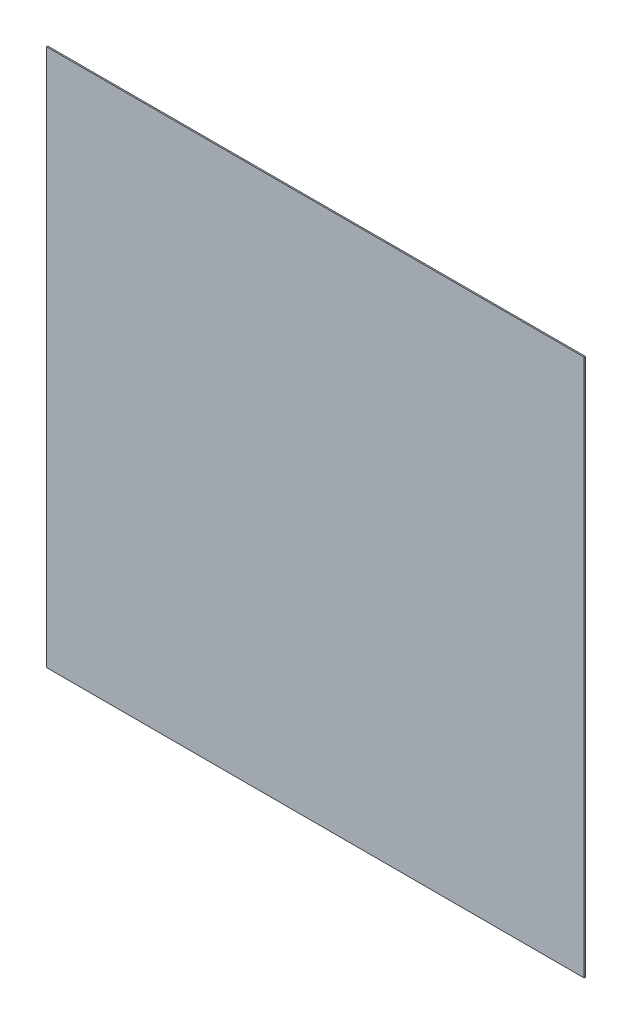
ISO-10303-21;
HEADER;
FILE_DESCRIPTION(('STEP AP214'),'2;1');
FILE_NAME('part.step','',(''),(''),'','','');
FILE_SCHEMA(('AUTOMOTIVE_DESIGN { 1 0 10303 214 1 1 1 1 }'));
ENDSEC;
DATA;
#1=APPLICATION_CONTEXT('core data for automotive mechanical design processes');
#2=APPLICATION_PROTOCOL_DEFINITION('international standard','automotive_design',2000,#1);
#3=PRODUCT_CONTEXT('',#1,'mechanical');
#4=PRODUCT('Part','Part','',(#3));
#5=PRODUCT_RELATED_PRODUCT_CATEGORY('part','',(#4));
#6=PRODUCT_DEFINITION_FORMATION('','',#4);
#7=PRODUCT_DEFINITION_CONTEXT('part definition',#1,'design');
#8=PRODUCT_DEFINITION('design','',#6,#7);
#9=PRODUCT_DEFINITION_SHAPE('','',#8);
#10=(LENGTH_UNIT() NAMED_UNIT(*) SI_UNIT(.MILLI.,.METRE.));
#11=(NAMED_UNIT(*) PLANE_ANGLE_UNIT() SI_UNIT($,.RADIAN.));
#12=(NAMED_UNIT(*) SI_UNIT($,.STERADIAN.) SOLID_ANGLE_UNIT());
#13=UNCERTAINTY_MEASURE_WITH_UNIT(LENGTH_MEASURE(1.E-05),#10,'distance_accuracy_value','');
#14=(GEOMETRIC_REPRESENTATION_CONTEXT(3) GLOBAL_UNCERTAINTY_ASSIGNED_CONTEXT((#13)) GLOBAL_UNIT_ASSIGNED_CONTEXT((#10,
#11,#12)) REPRESENTATION_CONTEXT('',''));
#15=CARTESIAN_POINT('',(0.,0.,0.));
#16=DIRECTION('',(0.,0.,1.));
#17=DIRECTION('',(1.,0.,0.));
#18=AXIS2_PLACEMENT_3D('',#15,#16,#17);
#19=CARTESIAN_POINT('',(313.,313.,1.5));
#20=DIRECTION('',(-1.,0.,0.));
#21=DIRECTION('',(0.,-1.,0.));
#22=AXIS2_PLACEMENT_3D('',#19,#20,#21);
#23=PLANE('',#22);
#24=DIRECTION('',(0.,1.,0.));
#25=VECTOR('',#24,1.);
#26=CARTESIAN_POINT('',(313.,313.,0.));
#27=LINE('',#26,#25);
#28=CARTESIAN_POINT('',(313.,-313.,0.));
#29=VERTEX_POINT('',#28);
#30=CARTESIAN_POINT('',(313.,313.,0.));
#31=VERTEX_POINT('',#30);
#32=EDGE_CURVE('E106',#29,#31,#27,.T.);
#33=ORIENTED_EDGE('',*,*,#32,.T.);
#34=DIRECTION('',(0.,0.,-1.));
#35=VECTOR('',#34,1.);
#36=CARTESIAN_POINT('',(313.,313.,1.5));
#37=LINE('',#36,#35);
#38=CARTESIAN_POINT('',(313.,313.,1.5));
#39=VERTEX_POINT('',#38);
#40=EDGE_CURVE('E97',#39,#31,#37,.T.);
#41=ORIENTED_EDGE('',*,*,#40,.F.);
#42=DIRECTION('',(0.,1.,0.));
#43=VECTOR('',#42,1.);
#44=CARTESIAN_POINT('',(313.,313.,1.5));
#45=LINE('',#44,#43);
#46=CARTESIAN_POINT('',(313.,-313.,1.5));
#47=VERTEX_POINT('',#46);
#48=EDGE_CURVE('E91',#47,#39,#45,.T.);
#49=ORIENTED_EDGE('',*,*,#48,.F.);
#50=DIRECTION('',(0.,0.,-1.));
#51=VECTOR('',#50,1.);
#52=CARTESIAN_POINT('',(313.,-313.,1.5));
#53=LINE('',#52,#51);
#54=EDGE_CURVE('E102',#47,#29,#53,.T.);
#55=ORIENTED_EDGE('',*,*,#54,.T.);
#56=EDGE_LOOP('',(#33,#41,#49,#55));
#57=FACE_BOUND('',#56,.T.);
#58=ADVANCED_FACE('F39',(#57),#23,.F.);
#59=CARTESIAN_POINT('',(-313.,313.,1.5));
#60=DIRECTION('',(0.,-1.,0.));
#61=DIRECTION('',(0.,0.,-1.));
#62=AXIS2_PLACEMENT_3D('',#59,#60,#61);
#63=PLANE('',#62);
#64=DIRECTION('',(-1.,0.,0.));
#65=VECTOR('',#64,1.);
#66=CARTESIAN_POINT('',(-313.,313.,0.));
#67=LINE('',#66,#65);
#68=CARTESIAN_POINT('',(-313.,313.,0.));
#69=VERTEX_POINT('',#68);
#70=EDGE_CURVE('E96',#31,#69,#67,.T.);
#71=ORIENTED_EDGE('',*,*,#70,.T.);
#72=DIRECTION('',(0.,0.,-1.));
#73=VECTOR('',#72,1.);
#74=CARTESIAN_POINT('',(-313.,313.,1.5));
#75=LINE('',#74,#73);
#76=CARTESIAN_POINT('',(-313.,313.,1.5));
#77=VERTEX_POINT('',#76);
#78=EDGE_CURVE('E94',#77,#69,#75,.T.);
#79=ORIENTED_EDGE('',*,*,#78,.F.);
#80=DIRECTION('',(-1.,0.,0.));
#81=VECTOR('',#80,1.);
#82=CARTESIAN_POINT('',(-313.,313.,1.5));
#83=LINE('',#82,#81);
#84=EDGE_CURVE('E86',#39,#77,#83,.T.);
#85=ORIENTED_EDGE('',*,*,#84,.F.);
#86=ORIENTED_EDGE('',*,*,#40,.T.);
#87=EDGE_LOOP('',(#71,#79,#85,#86));
#88=FACE_BOUND('',#87,.T.);
#89=ADVANCED_FACE('F95',(#88),#63,.F.);
#90=CARTESIAN_POINT('',(-313.,313.,1.5));
#91=DIRECTION('',(1.,0.,0.));
#92=DIRECTION('',(0.,1.,0.));
#93=AXIS2_PLACEMENT_3D('',#90,#91,#92);
#94=PLANE('',#93);
#95=DIRECTION('',(0.,-1.,0.));
#96=VECTOR('',#95,1.);
#97=CARTESIAN_POINT('',(-313.,313.,0.));
#98=LINE('',#97,#96);
#99=CARTESIAN_POINT('',(-313.,-313.,0.));
#100=VERTEX_POINT('',#99);
#101=EDGE_CURVE('E72',#69,#100,#98,.T.);
#102=ORIENTED_EDGE('',*,*,#101,.T.);
#103=DIRECTION('',(0.,0.,-1.));
#104=VECTOR('',#103,1.);
#105=CARTESIAN_POINT('',(-313.,-313.,1.5));
#106=LINE('',#105,#104);
#107=CARTESIAN_POINT('',(-313.,-313.,1.5));
#108=VERTEX_POINT('',#107);
#109=EDGE_CURVE('E98',#108,#100,#106,.T.);
#110=ORIENTED_EDGE('',*,*,#109,.F.);
#111=DIRECTION('',(0.,-1.,0.));
#112=VECTOR('',#111,1.);
#113=CARTESIAN_POINT('',(-313.,313.,1.5));
#114=LINE('',#113,#112);
#115=EDGE_CURVE('E89',#77,#108,#114,.T.);
#116=ORIENTED_EDGE('',*,*,#115,.F.);
#117=ORIENTED_EDGE('',*,*,#78,.T.);
#118=EDGE_LOOP('',(#102,#110,#116,#117));
#119=FACE_BOUND('',#118,.T.);
#120=ADVANCED_FACE('F100',(#119),#94,.F.);
#121=CARTESIAN_POINT('',(-313.,-313.,1.5));
#122=DIRECTION('',(0.,1.,0.));
#123=DIRECTION('',(0.,0.,1.));
#124=AXIS2_PLACEMENT_3D('',#121,#122,#123);
#125=PLANE('',#124);
#126=DIRECTION('',(1.,0.,0.));
#127=VECTOR('',#126,1.);
#128=CARTESIAN_POINT('',(-313.,-313.,0.));
#129=LINE('',#128,#127);
#130=EDGE_CURVE('E78',#100,#29,#129,.T.);
#131=ORIENTED_EDGE('',*,*,#130,.T.);
#132=ORIENTED_EDGE('',*,*,#54,.F.);
#133=DIRECTION('',(1.,0.,0.));
#134=VECTOR('',#133,1.);
#135=CARTESIAN_POINT('',(-313.,-313.,1.5));
#136=LINE('',#135,#134);
#137=EDGE_CURVE('E55',#108,#47,#136,.T.);
#138=ORIENTED_EDGE('',*,*,#137,.F.);
#139=ORIENTED_EDGE('',*,*,#109,.T.);
#140=EDGE_LOOP('',(#131,#132,#138,#139));
#141=FACE_BOUND('',#140,.T.);
#142=ADVANCED_FACE('F138',(#141),#125,.F.);
#143=CARTESIAN_POINT('',(0.,0.,1.5));
#144=DIRECTION('',(0.,0.,1.));
#145=DIRECTION('',(1.,0.,0.));
#146=AXIS2_PLACEMENT_3D('',#143,#144,#145);
#147=PLANE('',#146);
#148=ORIENTED_EDGE('',*,*,#48,.T.);
#149=ORIENTED_EDGE('',*,*,#84,.T.);
#150=ORIENTED_EDGE('',*,*,#115,.T.);
#151=ORIENTED_EDGE('',*,*,#137,.T.);
#152=EDGE_LOOP('',(#148,#149,#150,#151));
#153=FACE_BOUND('',#152,.T.);
#154=ADVANCED_FACE('F87',(#153),#147,.T.);
#155=CARTESIAN_POINT('',(0.,0.,0.));
#156=DIRECTION('',(0.,0.,1.));
#157=DIRECTION('',(1.,0.,0.));
#158=AXIS2_PLACEMENT_3D('',#155,#156,#157);
#159=PLANE('',#158);
#160=CARTESIAN_POINT('',(-293.,0.,0.));
#161=DIRECTION('',(0.,0.,1.));
#162=DIRECTION('',(1.,0.,0.));
#163=AXIS2_PLACEMENT_3D('',#160,#161,#162);
#164=CIRCLE('',#163,4.99999999999999);
#165=CARTESIAN_POINT('',(-288.,0.,0.));
#166=VERTEX_POINT('',#165);
#167=EDGE_CURVE('E11',#166,#166,#164,.F.);
#168=ORIENTED_EDGE('',*,*,#167,.F.);
#169=EDGE_LOOP('',(#168));
#170=FACE_BOUND('',#169,.T.);
#171=CARTESIAN_POINT('',(0.,-293.,0.));
#172=DIRECTION('',(0.,0.,1.));
#173=DIRECTION('',(1.,0.,0.));
#174=AXIS2_PLACEMENT_3D('',#171,#172,#173);
#175=CIRCLE('',#174,5.00000000000001);
#176=CARTESIAN_POINT('',(5.00000000000006,-293.,0.));
#177=VERTEX_POINT('',#176);
#178=EDGE_CURVE('E47',#177,#177,#175,.F.);
#179=ORIENTED_EDGE('',*,*,#178,.F.);
#180=EDGE_LOOP('',(#179));
#181=FACE_BOUND('',#180,.T.);
#182=CARTESIAN_POINT('',(293.,0.,0.));
#183=DIRECTION('',(0.,0.,1.));
#184=DIRECTION('',(1.,0.,0.));
#185=AXIS2_PLACEMENT_3D('',#182,#183,#184);
#186=CIRCLE('',#185,4.99999999999999);
#187=CARTESIAN_POINT('',(298.,0.,0.));
#188=VERTEX_POINT('',#187);
#189=EDGE_CURVE('E119',#188,#188,#186,.F.);
#190=ORIENTED_EDGE('',*,*,#189,.F.);
#191=EDGE_LOOP('',(#190));
#192=FACE_BOUND('',#191,.T.);
#193=CARTESIAN_POINT('',(0.,293.,0.));
#194=DIRECTION('',(0.,0.,1.));
#195=DIRECTION('',(1.,0.,0.));
#196=AXIS2_PLACEMENT_3D('',#193,#194,#195);
#197=CIRCLE('',#196,5.00000000000001);
#198=CARTESIAN_POINT('',(5.00000000000006,293.,0.));
#199=VERTEX_POINT('',#198);
#200=EDGE_CURVE('E116',#199,#199,#197,.F.);
#201=ORIENTED_EDGE('',*,*,#200,.F.);
#202=EDGE_LOOP('',(#201));
#203=FACE_BOUND('',#202,.T.);
#204=ORIENTED_EDGE('',*,*,#32,.F.);
#205=ORIENTED_EDGE('',*,*,#130,.F.);
#206=ORIENTED_EDGE('',*,*,#101,.F.);
#207=ORIENTED_EDGE('',*,*,#70,.F.);
#208=EDGE_LOOP('',(#204,#205,#206,#207));
#209=FACE_BOUND('',#208,.T.);
#210=ADVANCED_FACE('F126',(#170,#181,#192,#203,#209),#159,.F.);
#211=CARTESIAN_POINT('',(0.,293.,-1.5));
#212=DIRECTION('',(0.,0.,1.));
#213=DIRECTION('',(1.,0.,0.));
#214=AXIS2_PLACEMENT_3D('',#211,#212,#213);
#215=CYLINDRICAL_SURFACE('',#214,5.00000000000001);
#216=CARTESIAN_POINT('',(0.,293.,-1.5));
#217=DIRECTION('',(0.,0.,-1.));
#218=DIRECTION('',(-1.,0.,0.));
#219=AXIS2_PLACEMENT_3D('',#216,#217,#218);
#220=CIRCLE('',#219,5.00000000000001);
#221=CARTESIAN_POINT('',(-4.99999999999995,293.,-1.5));
#222=VERTEX_POINT('',#221);
#223=EDGE_CURVE('E109',#222,#222,#220,.T.);
#224=ORIENTED_EDGE('',*,*,#223,.F.);
#225=EDGE_LOOP('',(#224));
#226=FACE_BOUND('',#225,.T.);
#227=ORIENTED_EDGE('',*,*,#200,.T.);
#228=EDGE_LOOP('',(#227));
#229=FACE_BOUND('',#228,.T.);
#230=ADVANCED_FACE('F129',(#226,#229),#215,.T.);
#231=CARTESIAN_POINT('',(0.,293.,-1.5));
#232=DIRECTION('',(0.,0.,-1.));
#233=DIRECTION('',(-1.,0.,0.));
#234=AXIS2_PLACEMENT_3D('',#231,#232,#233);
#235=PLANE('',#234);
#236=ORIENTED_EDGE('',*,*,#223,.T.);
#237=EDGE_LOOP('',(#236));
#238=FACE_BOUND('',#237,.T.);
#239=ADVANCED_FACE('F186',(#238),#235,.T.);
#240=CARTESIAN_POINT('',(293.,0.,-1.5));
#241=DIRECTION('',(0.,0.,1.));
#242=DIRECTION('',(1.,0.,0.));
#243=AXIS2_PLACEMENT_3D('',#240,#241,#242);
#244=CYLINDRICAL_SURFACE('',#243,4.99999999999999);
#245=CARTESIAN_POINT('',(293.,0.,-1.5));
#246=DIRECTION('',(0.,0.,-1.));
#247=DIRECTION('',(-1.,0.,0.));
#248=AXIS2_PLACEMENT_3D('',#245,#246,#247);
#249=CIRCLE('',#248,4.99999999999999);
#250=CARTESIAN_POINT('',(288.,0.,-1.5));
#251=VERTEX_POINT('',#250);
#252=EDGE_CURVE('E295',#251,#251,#249,.T.);
#253=ORIENTED_EDGE('',*,*,#252,.F.);
#254=EDGE_LOOP('',(#253));
#255=FACE_BOUND('',#254,.T.);
#256=ORIENTED_EDGE('',*,*,#189,.T.);
#257=EDGE_LOOP('',(#256));
#258=FACE_BOUND('',#257,.T.);
#259=ADVANCED_FACE('F197',(#255,#258),#244,.T.);
#260=CARTESIAN_POINT('',(293.,0.,-1.5));
#261=DIRECTION('',(0.,0.,-1.));
#262=DIRECTION('',(-1.,0.,0.));
#263=AXIS2_PLACEMENT_3D('',#260,#261,#262);
#264=PLANE('',#263);
#265=ORIENTED_EDGE('',*,*,#252,.T.);
#266=EDGE_LOOP('',(#265));
#267=FACE_BOUND('',#266,.T.);
#268=ADVANCED_FACE('F208',(#267),#264,.T.);
#269=CARTESIAN_POINT('',(0.,-293.,-1.5));
#270=DIRECTION('',(0.,0.,1.));
#271=DIRECTION('',(1.,0.,0.));
#272=AXIS2_PLACEMENT_3D('',#269,#270,#271);
#273=CYLINDRICAL_SURFACE('',#272,5.00000000000001);
#274=CARTESIAN_POINT('',(0.,-293.,-1.5));
#275=DIRECTION('',(0.,0.,-1.));
#276=DIRECTION('',(1.,0.,0.));
#277=AXIS2_PLACEMENT_3D('',#274,#275,#276);
#278=CIRCLE('',#277,5.00000000000001);
#279=CARTESIAN_POINT('',(5.00000000000006,-293.,-1.5));
#280=VERTEX_POINT('',#279);
#281=EDGE_CURVE('E292',#280,#280,#278,.T.);
#282=ORIENTED_EDGE('',*,*,#281,.F.);
#283=EDGE_LOOP('',(#282));
#284=FACE_BOUND('',#283,.T.);
#285=ORIENTED_EDGE('',*,*,#178,.T.);
#286=EDGE_LOOP('',(#285));
#287=FACE_BOUND('',#286,.T.);
#288=ADVANCED_FACE('F124',(#284,#287),#273,.T.);
#289=CARTESIAN_POINT('',(0.,-293.,-1.5));
#290=DIRECTION('',(0.,0.,1.));
#291=DIRECTION('',(1.,0.,0.));
#292=AXIS2_PLACEMENT_3D('',#289,#290,#291);
#293=PLANE('',#292);
#294=ORIENTED_EDGE('',*,*,#281,.T.);
#295=EDGE_LOOP('',(#294));
#296=FACE_BOUND('',#295,.T.);
#297=ADVANCED_FACE('F229',(#296),#293,.F.);
#298=CARTESIAN_POINT('',(-293.,0.,-1.5));
#299=DIRECTION('',(0.,0.,1.));
#300=DIRECTION('',(1.,0.,0.));
#301=AXIS2_PLACEMENT_3D('',#298,#299,#300);
#302=CYLINDRICAL_SURFACE('',#301,4.99999999999999);
#303=CARTESIAN_POINT('',(-293.,0.,-1.5));
#304=DIRECTION('',(0.,0.,-1.));
#305=DIRECTION('',(1.,0.,0.));
#306=AXIS2_PLACEMENT_3D('',#303,#304,#305);
#307=CIRCLE('',#306,4.99999999999999);
#308=CARTESIAN_POINT('',(-288.,0.,-1.5));
#309=VERTEX_POINT('',#308);
#310=EDGE_CURVE('E291',#309,#309,#307,.T.);
#311=ORIENTED_EDGE('',*,*,#310,.F.);
#312=EDGE_LOOP('',(#311));
#313=FACE_BOUND('',#312,.T.);
#314=ORIENTED_EDGE('',*,*,#167,.T.);
#315=EDGE_LOOP('',(#314));
#316=FACE_BOUND('',#315,.T.);
#317=ADVANCED_FACE('F240',(#313,#316),#302,.T.);
#318=CARTESIAN_POINT('',(-293.,0.,-1.5));
#319=DIRECTION('',(0.,0.,1.));
#320=DIRECTION('',(1.,0.,0.));
#321=AXIS2_PLACEMENT_3D('',#318,#319,#320);
#322=PLANE('',#321);
#323=ORIENTED_EDGE('',*,*,#310,.T.);
#324=EDGE_LOOP('',(#323));
#325=FACE_BOUND('',#324,.T.);
#326=ADVANCED_FACE('F251',(#325),#322,.F.);
#327=CLOSED_SHELL('',(#58,#89,#120,#142,#154,#210,#230,#239,#259,#268,#288,#297,#317,#326));
#328=MANIFOLD_SOLID_BREP('B2',#327);
#329=ADVANCED_BREP_SHAPE_REPRESENTATION('',(#18,#328),#14);
#330=SHAPE_DEFINITION_REPRESENTATION(#9,#329);
ENDSEC;
END-ISO-10303-21;
